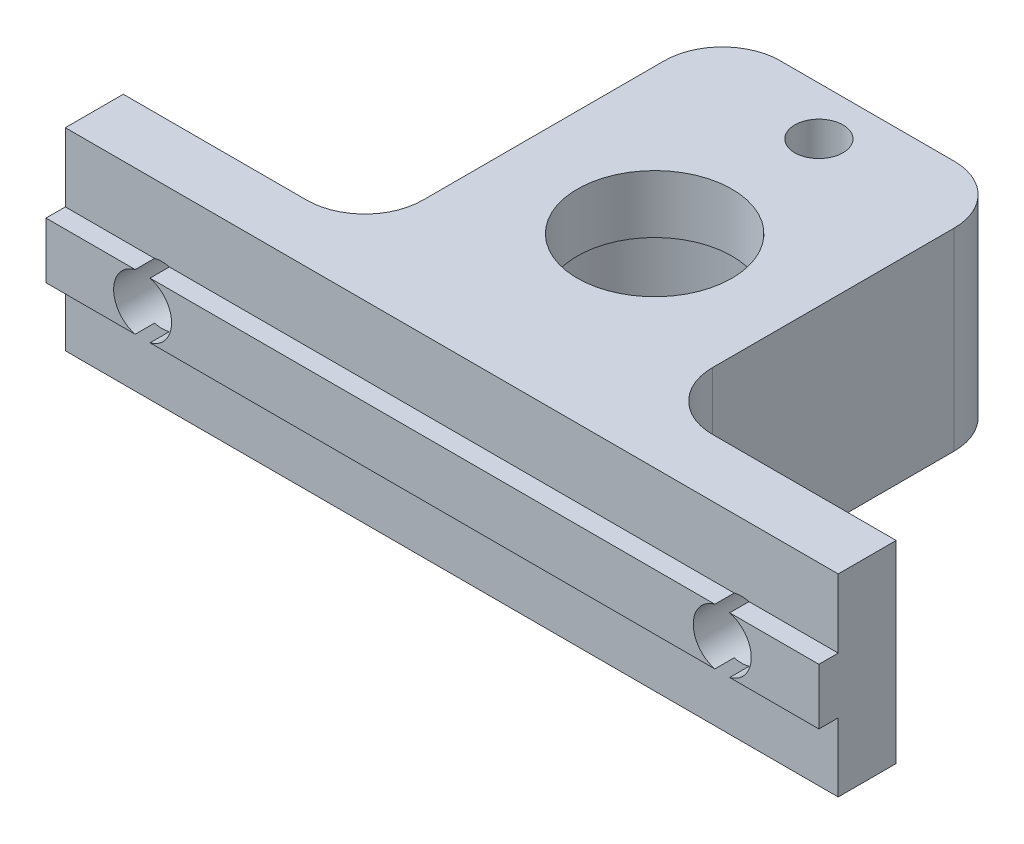
ISO-10303-21;
HEADER;
FILE_DESCRIPTION(('STEP AP214'),'2;1');
FILE_NAME('part.step','',(''),(''),'','','');
FILE_SCHEMA(('AUTOMOTIVE_DESIGN { 1 0 10303 214 1 1 1 1 }'));
ENDSEC;
DATA;
#1=APPLICATION_CONTEXT('core data for automotive mechanical design processes');
#2=APPLICATION_PROTOCOL_DEFINITION('international standard','automotive_design',2000,#1);
#3=PRODUCT_CONTEXT('',#1,'mechanical');
#4=PRODUCT('Part','Part','',(#3));
#5=PRODUCT_RELATED_PRODUCT_CATEGORY('part','',(#4));
#6=PRODUCT_DEFINITION_FORMATION('','',#4);
#7=PRODUCT_DEFINITION_CONTEXT('part definition',#1,'design');
#8=PRODUCT_DEFINITION('design','',#6,#7);
#9=PRODUCT_DEFINITION_SHAPE('','',#8);
#10=(LENGTH_UNIT() NAMED_UNIT(*) SI_UNIT(.MILLI.,.METRE.));
#11=(NAMED_UNIT(*) PLANE_ANGLE_UNIT() SI_UNIT($,.RADIAN.));
#12=(NAMED_UNIT(*) SI_UNIT($,.STERADIAN.) SOLID_ANGLE_UNIT());
#13=UNCERTAINTY_MEASURE_WITH_UNIT(LENGTH_MEASURE(1.E-05),#10,'distance_accuracy_value','');
#14=(GEOMETRIC_REPRESENTATION_CONTEXT(3) GLOBAL_UNCERTAINTY_ASSIGNED_CONTEXT((#13)) GLOBAL_UNIT_ASSIGNED_CONTEXT((#10,
#11,#12)) REPRESENTATION_CONTEXT('',''));
#15=CARTESIAN_POINT('',(0.,0.,0.));
#16=DIRECTION('',(0.,0.,1.));
#17=DIRECTION('',(1.,0.,0.));
#18=AXIS2_PLACEMENT_3D('',#15,#16,#17);
#19=CARTESIAN_POINT('',(0.,0.,0.));
#20=DIRECTION('',(0.,0.,-1.));
#21=DIRECTION('',(-1.,0.,0.));
#22=AXIS2_PLACEMENT_3D('',#19,#20,#21);
#23=PLANE('',#22);
#24=CARTESIAN_POINT('',(-15.,5.,0.));
#25=DIRECTION('',(0.,0.,-1.));
#26=DIRECTION('',(-1.,0.,0.));
#27=AXIS2_PLACEMENT_3D('',#24,#25,#26);
#28=CIRCLE('',#27,1.5);
#29=CARTESIAN_POINT('',(-16.5,5.,0.));
#30=VERTEX_POINT('',#29);
#31=EDGE_CURVE('E216',#30,#30,#28,.T.);
#32=ORIENTED_EDGE('',*,*,#31,.F.);
#33=EDGE_LOOP('',(#32));
#34=FACE_BOUND('',#33,.T.);
#35=DIRECTION('',(-1.,0.,0.));
#36=VECTOR('',#35,1.);
#37=CARTESIAN_POINT('',(-20.,10.,0.));
#38=LINE('',#37,#36);
#39=CARTESIAN_POINT('',(-10.5,10.,0.));
#40=VERTEX_POINT('',#39);
#41=CARTESIAN_POINT('',(-20.,10.,0.));
#42=VERTEX_POINT('',#41);
#43=EDGE_CURVE('E281',#40,#42,#38,.T.);
#44=ORIENTED_EDGE('',*,*,#43,.F.);
#45=DIRECTION('',(0.,-1.,0.));
#46=VECTOR('',#45,1.);
#47=CARTESIAN_POINT('',(-10.5,0.,0.));
#48=LINE('',#47,#46);
#49=CARTESIAN_POINT('',(-10.5,0.,0.));
#50=VERTEX_POINT('',#49);
#51=EDGE_CURVE('E326',#40,#50,#48,.T.);
#52=ORIENTED_EDGE('',*,*,#51,.T.);
#53=DIRECTION('',(1.,0.,0.));
#54=VECTOR('',#53,1.);
#55=CARTESIAN_POINT('',(-20.,0.,0.));
#56=LINE('',#55,#54);
#57=CARTESIAN_POINT('',(-20.,0.,0.));
#58=VERTEX_POINT('',#57);
#59=EDGE_CURVE('E276',#58,#50,#56,.T.);
#60=ORIENTED_EDGE('',*,*,#59,.F.);
#61=DIRECTION('',(0.,-1.,0.));
#62=VECTOR('',#61,1.);
#63=CARTESIAN_POINT('',(-20.,0.,0.));
#64=LINE('',#63,#62);
#65=EDGE_CURVE('E259',#42,#58,#64,.T.);
#66=ORIENTED_EDGE('',*,*,#65,.F.);
#67=EDGE_LOOP('',(#44,#52,#60,#66));
#68=FACE_BOUND('',#67,.T.);
#69=ADVANCED_FACE('F33',(#34,#68),#23,.T.);
#70=CARTESIAN_POINT('',(20.,6.45000000000001,4.));
#71=DIRECTION('',(0.,-1.,0.));
#72=DIRECTION('',(1.,0.,0.));
#73=AXIS2_PLACEMENT_3D('',#70,#71,#72);
#74=PLANE('',#73);
#75=DIRECTION('',(-1.,0.,0.));
#76=VECTOR('',#75,1.);
#77=CARTESIAN_POINT('',(20.,6.45000000000001,4.));
#78=LINE('',#77,#76);
#79=CARTESIAN_POINT('',(-15.3840572873934,6.45,4.));
#80=VERTEX_POINT('',#79);
#81=CARTESIAN_POINT('',(-20.,6.45,4.));
#82=VERTEX_POINT('',#81);
#83=EDGE_CURVE('E211',#80,#82,#78,.T.);
#84=ORIENTED_EDGE('',*,*,#83,.F.);
#85=DIRECTION('',(0.,0.,-1.));
#86=VECTOR('',#85,1.);
#87=CARTESIAN_POINT('',(-15.3840572873934,6.45,4.));
#88=LINE('',#87,#86);
#89=CARTESIAN_POINT('',(-15.3840572873934,6.45,3.));
#90=VERTEX_POINT('',#89);
#91=EDGE_CURVE('E195',#80,#90,#88,.T.);
#92=ORIENTED_EDGE('',*,*,#91,.T.);
#93=DIRECTION('',(-1.,0.,0.));
#94=VECTOR('',#93,1.);
#95=CARTESIAN_POINT('',(20.,6.45000000000001,3.));
#96=LINE('',#95,#94);
#97=CARTESIAN_POINT('',(-20.,6.45,3.));
#98=VERTEX_POINT('',#97);
#99=EDGE_CURVE('E246',#90,#98,#96,.T.);
#100=ORIENTED_EDGE('',*,*,#99,.T.);
#101=DIRECTION('',(0.,0.,-1.));
#102=VECTOR('',#101,1.);
#103=CARTESIAN_POINT('',(-20.,6.45,4.));
#104=LINE('',#103,#102);
#105=EDGE_CURVE('E220',#82,#98,#104,.T.);
#106=ORIENTED_EDGE('',*,*,#105,.F.);
#107=EDGE_LOOP('',(#84,#92,#100,#106));
#108=FACE_BOUND('',#107,.T.);
#109=ADVANCED_FACE('F218',(#108),#74,.F.);
#110=CARTESIAN_POINT('',(0.,0.,4.));
#111=DIRECTION('',(0.,0.,1.));
#112=DIRECTION('',(1.,0.,0.));
#113=AXIS2_PLACEMENT_3D('',#110,#111,#112);
#114=PLANE('',#113);
#115=CARTESIAN_POINT('',(-15.,5.,4.));
#116=DIRECTION('',(0.,0.,-1.));
#117=DIRECTION('',(-1.,0.,0.));
#118=AXIS2_PLACEMENT_3D('',#115,#116,#117);
#119=CIRCLE('',#118,1.5);
#120=CARTESIAN_POINT('',(-15.3840572873935,3.55,4.));
#121=VERTEX_POINT('',#120);
#122=EDGE_CURVE('E198',#121,#80,#119,.T.);
#123=ORIENTED_EDGE('',*,*,#122,.T.);
#124=ORIENTED_EDGE('',*,*,#83,.T.);
#125=DIRECTION('',(0.,-1.,0.));
#126=VECTOR('',#125,1.);
#127=CARTESIAN_POINT('',(-20.,3.55,4.));
#128=LINE('',#127,#126);
#129=CARTESIAN_POINT('',(-20.,3.55,4.));
#130=VERTEX_POINT('',#129);
#131=EDGE_CURVE('E232',#82,#130,#128,.T.);
#132=ORIENTED_EDGE('',*,*,#131,.T.);
#133=DIRECTION('',(1.,0.,0.));
#134=VECTOR('',#133,1.);
#135=CARTESIAN_POINT('',(20.,3.55000000000001,4.));
#136=LINE('',#135,#134);
#137=EDGE_CURVE('E214',#130,#121,#136,.T.);
#138=ORIENTED_EDGE('',*,*,#137,.T.);
#139=EDGE_LOOP('',(#123,#124,#132,#138));
#140=FACE_BOUND('',#139,.T.);
#141=ADVANCED_FACE('F210',(#140),#114,.T.);
#142=CARTESIAN_POINT('',(20.,3.55000000000001,4.));
#143=DIRECTION('',(0.,1.,0.));
#144=DIRECTION('',(-1.,0.,0.));
#145=AXIS2_PLACEMENT_3D('',#142,#143,#144);
#146=PLANE('',#145);
#147=CARTESIAN_POINT('',(-14.6159427126066,3.55,4.));
#148=VERTEX_POINT('',#147);
#149=CARTESIAN_POINT('',(14.6159427126066,3.55000000000001,4.));
#150=VERTEX_POINT('',#149);
#151=EDGE_CURVE('E237',#148,#150,#136,.T.);
#152=ORIENTED_EDGE('',*,*,#151,.F.);
#153=DIRECTION('',(0.,0.,-1.));
#154=VECTOR('',#153,1.);
#155=CARTESIAN_POINT('',(-14.6159427126066,3.55,4.));
#156=LINE('',#155,#154);
#157=CARTESIAN_POINT('',(-14.6159427126066,3.55,3.));
#158=VERTEX_POINT('',#157);
#159=EDGE_CURVE('E301',#148,#158,#156,.T.);
#160=ORIENTED_EDGE('',*,*,#159,.T.);
#161=DIRECTION('',(1.,0.,0.));
#162=VECTOR('',#161,1.);
#163=CARTESIAN_POINT('',(20.,3.55000000000001,3.));
#164=LINE('',#163,#162);
#165=CARTESIAN_POINT('',(14.6159427126066,3.55000000000001,3.));
#166=VERTEX_POINT('',#165);
#167=EDGE_CURVE('E249',#158,#166,#164,.T.);
#168=ORIENTED_EDGE('',*,*,#167,.T.);
#169=DIRECTION('',(0.,0.,-1.));
#170=VECTOR('',#169,1.);
#171=CARTESIAN_POINT('',(14.6159427126066,3.55000000000001,4.));
#172=LINE('',#171,#170);
#173=EDGE_CURVE('E379',#166,#150,#172,.F.);
#174=ORIENTED_EDGE('',*,*,#173,.T.);
#175=EDGE_LOOP('',(#152,#160,#168,#174));
#176=FACE_BOUND('',#175,.T.);
#177=ADVANCED_FACE('F516',(#176),#146,.F.);
#178=CARTESIAN_POINT('',(14.6159427126066,6.45000000000001,3.));
#179=VERTEX_POINT('',#178);
#180=CARTESIAN_POINT('',(-14.6159427126066,6.45,3.));
#181=VERTEX_POINT('',#180);
#182=EDGE_CURVE('E245',#179,#181,#96,.T.);
#183=ORIENTED_EDGE('',*,*,#182,.T.);
#184=DIRECTION('',(0.,0.,-1.));
#185=VECTOR('',#184,1.);
#186=CARTESIAN_POINT('',(-14.6159427126066,6.45,4.));
#187=LINE('',#186,#185);
#188=CARTESIAN_POINT('',(-14.6159427126066,6.45,4.));
#189=VERTEX_POINT('',#188);
#190=EDGE_CURVE('E206',#181,#189,#187,.F.);
#191=ORIENTED_EDGE('',*,*,#190,.T.);
#192=CARTESIAN_POINT('',(14.6159427126066,6.45000000000001,4.));
#193=VERTEX_POINT('',#192);
#194=EDGE_CURVE('E222',#193,#189,#78,.T.);
#195=ORIENTED_EDGE('',*,*,#194,.F.);
#196=DIRECTION('',(0.,0.,-1.));
#197=VECTOR('',#196,1.);
#198=CARTESIAN_POINT('',(14.6159427126066,6.45000000000001,4.));
#199=LINE('',#198,#197);
#200=EDGE_CURVE('E394',#193,#179,#199,.T.);
#201=ORIENTED_EDGE('',*,*,#200,.T.);
#202=EDGE_LOOP('',(#183,#191,#195,#201));
#203=FACE_BOUND('',#202,.T.);
#204=ADVANCED_FACE('F400',(#203),#74,.F.);
#205=CARTESIAN_POINT('',(15.3840572873934,3.55000000000001,4.));
#206=VERTEX_POINT('',#205);
#207=CARTESIAN_POINT('',(20.,3.55000000000001,4.));
#208=VERTEX_POINT('',#207);
#209=EDGE_CURVE('E235',#206,#208,#136,.T.);
#210=ORIENTED_EDGE('',*,*,#209,.F.);
#211=DIRECTION('',(0.,0.,-1.));
#212=VECTOR('',#211,1.);
#213=CARTESIAN_POINT('',(15.3840572873934,3.55000000000001,4.));
#214=LINE('',#213,#212);
#215=CARTESIAN_POINT('',(15.3840572873934,3.55000000000001,3.));
#216=VERTEX_POINT('',#215);
#217=EDGE_CURVE('E385',#206,#216,#214,.T.);
#218=ORIENTED_EDGE('',*,*,#217,.T.);
#219=CARTESIAN_POINT('',(20.,3.55000000000001,3.));
#220=VERTEX_POINT('',#219);
#221=EDGE_CURVE('E244',#216,#220,#164,.T.);
#222=ORIENTED_EDGE('',*,*,#221,.T.);
#223=DIRECTION('',(0.,0.,-1.));
#224=VECTOR('',#223,1.);
#225=CARTESIAN_POINT('',(20.,3.55000000000001,4.));
#226=LINE('',#225,#224);
#227=EDGE_CURVE('E240',#208,#220,#226,.T.);
#228=ORIENTED_EDGE('',*,*,#227,.F.);
#229=EDGE_LOOP('',(#210,#218,#222,#228));
#230=FACE_BOUND('',#229,.T.);
#231=ADVANCED_FACE('F421',(#230),#146,.F.);
#232=EDGE_CURVE('E215',#189,#148,#119,.T.);
#233=ORIENTED_EDGE('',*,*,#232,.T.);
#234=ORIENTED_EDGE('',*,*,#151,.T.);
#235=CARTESIAN_POINT('',(15.,5.00000000000001,4.));
#236=DIRECTION('',(0.,0.,1.));
#237=DIRECTION('',(1.,0.,0.));
#238=AXIS2_PLACEMENT_3D('',#235,#236,#237);
#239=CIRCLE('',#238,1.5);
#240=EDGE_CURVE('E298',#193,#150,#239,.T.);
#241=ORIENTED_EDGE('',*,*,#240,.F.);
#242=ORIENTED_EDGE('',*,*,#194,.T.);
#243=EDGE_LOOP('',(#233,#234,#241,#242));
#244=FACE_BOUND('',#243,.T.);
#245=ADVANCED_FACE('F514',(#244),#114,.T.);
#246=CARTESIAN_POINT('',(0.,0.,3.));
#247=DIRECTION('',(0.,0.,-1.));
#248=DIRECTION('',(-1.,0.,0.));
#249=AXIS2_PLACEMENT_3D('',#246,#247,#248);
#250=PLANE('',#249);
#251=ORIENTED_EDGE('',*,*,#167,.F.);
#252=CARTESIAN_POINT('',(-15.,5.,3.));
#253=DIRECTION('',(0.,0.,-1.));
#254=DIRECTION('',(-1.,0.,0.));
#255=AXIS2_PLACEMENT_3D('',#252,#253,#254);
#256=CIRCLE('',#255,1.5);
#257=CARTESIAN_POINT('',(-15.3840572873935,3.55,3.));
#258=VERTEX_POINT('',#257);
#259=EDGE_CURVE('E371',#158,#258,#256,.T.);
#260=ORIENTED_EDGE('',*,*,#259,.T.);
#261=CARTESIAN_POINT('',(-20.,3.55000000000001,3.));
#262=VERTEX_POINT('',#261);
#263=EDGE_CURVE('E228',#262,#258,#164,.T.);
#264=ORIENTED_EDGE('',*,*,#263,.F.);
#265=DIRECTION('',(0.,-1.,0.));
#266=VECTOR('',#265,1.);
#267=CARTESIAN_POINT('',(-20.,0.,3.));
#268=LINE('',#267,#266);
#269=CARTESIAN_POINT('',(-20.,0.,3.));
#270=VERTEX_POINT('',#269);
#271=EDGE_CURVE('E264',#262,#270,#268,.T.);
#272=ORIENTED_EDGE('',*,*,#271,.T.);
#273=DIRECTION('',(1.,0.,0.));
#274=VECTOR('',#273,1.);
#275=CARTESIAN_POINT('',(-20.,0.,3.));
#276=LINE('',#275,#274);
#277=CARTESIAN_POINT('',(20.,0.,3.));
#278=VERTEX_POINT('',#277);
#279=EDGE_CURVE('E263',#270,#278,#276,.T.);
#280=ORIENTED_EDGE('',*,*,#279,.T.);
#281=DIRECTION('',(0.,1.,0.));
#282=VECTOR('',#281,1.);
#283=CARTESIAN_POINT('',(20.,0.,3.));
#284=LINE('',#283,#282);
#285=EDGE_CURVE('E267',#278,#220,#284,.T.);
#286=ORIENTED_EDGE('',*,*,#285,.T.);
#287=ORIENTED_EDGE('',*,*,#221,.F.);
#288=CARTESIAN_POINT('',(15.,5.00000000000001,3.));
#289=DIRECTION('',(0.,0.,-1.));
#290=DIRECTION('',(-1.,0.,0.));
#291=AXIS2_PLACEMENT_3D('',#288,#289,#290);
#292=CIRCLE('',#291,1.5);
#293=EDGE_CURVE('E382',#216,#166,#292,.T.);
#294=ORIENTED_EDGE('',*,*,#293,.T.);
#295=EDGE_LOOP('',(#251,#260,#264,#272,#280,#286,#287,#294));
#296=FACE_BOUND('',#295,.T.);
#297=ADVANCED_FACE('F414',(#296),#250,.F.);
#298=ORIENTED_EDGE('',*,*,#99,.F.);
#299=CARTESIAN_POINT('',(-15.,5.,3.));
#300=DIRECTION('',(0.,0.,-1.));
#301=DIRECTION('',(-1.,0.,0.));
#302=AXIS2_PLACEMENT_3D('',#299,#300,#301);
#303=CIRCLE('',#302,1.5);
#304=EDGE_CURVE('E201',#90,#181,#303,.T.);
#305=ORIENTED_EDGE('',*,*,#304,.T.);
#306=ORIENTED_EDGE('',*,*,#182,.F.);
#307=CARTESIAN_POINT('',(15.,5.00000000000001,3.));
#308=DIRECTION('',(0.,0.,-1.));
#309=DIRECTION('',(-1.,0.,0.));
#310=AXIS2_PLACEMENT_3D('',#307,#308,#309);
#311=CIRCLE('',#310,1.5);
#312=CARTESIAN_POINT('',(15.3840572873934,6.45000000000001,3.));
#313=VERTEX_POINT('',#312);
#314=EDGE_CURVE('E391',#179,#313,#311,.T.);
#315=ORIENTED_EDGE('',*,*,#314,.T.);
#316=CARTESIAN_POINT('',(20.,6.45000000000001,3.));
#317=VERTEX_POINT('',#316);
#318=EDGE_CURVE('E241',#317,#313,#96,.T.);
#319=ORIENTED_EDGE('',*,*,#318,.F.);
#320=CARTESIAN_POINT('',(20.,10.,3.));
#321=VERTEX_POINT('',#320);
#322=EDGE_CURVE('E266',#317,#321,#284,.T.);
#323=ORIENTED_EDGE('',*,*,#322,.T.);
#324=DIRECTION('',(-1.,0.,0.));
#325=VECTOR('',#324,1.);
#326=CARTESIAN_POINT('',(-20.,10.,3.));
#327=LINE('',#326,#325);
#328=CARTESIAN_POINT('',(-20.,10.,3.));
#329=VERTEX_POINT('',#328);
#330=EDGE_CURVE('E270',#321,#329,#327,.T.);
#331=ORIENTED_EDGE('',*,*,#330,.T.);
#332=EDGE_CURVE('E260',#329,#98,#268,.T.);
#333=ORIENTED_EDGE('',*,*,#332,.T.);
#334=EDGE_LOOP('',(#298,#305,#306,#315,#319,#323,#331,#333));
#335=FACE_BOUND('',#334,.T.);
#336=ADVANCED_FACE('F402',(#335),#250,.F.);
#337=CARTESIAN_POINT('',(-20.,0.,3.));
#338=DIRECTION('',(1.,0.,0.));
#339=DIRECTION('',(0.,0.,-1.));
#340=AXIS2_PLACEMENT_3D('',#337,#338,#339);
#341=PLANE('',#340);
#342=ORIENTED_EDGE('',*,*,#65,.T.);
#343=DIRECTION('',(0.,0.,-1.));
#344=VECTOR('',#343,1.);
#345=CARTESIAN_POINT('',(-20.,0.,3.));
#346=LINE('',#345,#344);
#347=EDGE_CURVE('E293',#270,#58,#346,.T.);
#348=ORIENTED_EDGE('',*,*,#347,.F.);
#349=ORIENTED_EDGE('',*,*,#271,.F.);
#350=DIRECTION('',(0.,0.,-1.));
#351=VECTOR('',#350,1.);
#352=CARTESIAN_POINT('',(-20.,3.55,4.));
#353=LINE('',#352,#351);
#354=EDGE_CURVE('E252',#130,#262,#353,.T.);
#355=ORIENTED_EDGE('',*,*,#354,.F.);
#356=ORIENTED_EDGE('',*,*,#131,.F.);
#357=ORIENTED_EDGE('',*,*,#105,.T.);
#358=ORIENTED_EDGE('',*,*,#332,.F.);
#359=DIRECTION('',(0.,0.,-1.));
#360=VECTOR('',#359,1.);
#361=CARTESIAN_POINT('',(-20.,10.,3.));
#362=LINE('',#361,#360);
#363=EDGE_CURVE('E272',#329,#42,#362,.T.);
#364=ORIENTED_EDGE('',*,*,#363,.T.);
#365=EDGE_LOOP('',(#342,#348,#349,#355,#356,#357,#358,#364));
#366=FACE_BOUND('',#365,.T.);
#367=ADVANCED_FACE('F407',(#366),#341,.F.);
#368=CARTESIAN_POINT('',(-20.,0.,3.));
#369=DIRECTION('',(0.,1.,0.));
#370=DIRECTION('',(-1.,0.,0.));
#371=AXIS2_PLACEMENT_3D('',#368,#369,#370);
#372=PLANE('',#371);
#373=CARTESIAN_POINT('',(0.,0.,-16.));
#374=DIRECTION('',(0.,1.,0.));
#375=DIRECTION('',(-1.,0.,0.));
#376=AXIS2_PLACEMENT_3D('',#373,#374,#375);
#377=CIRCLE('',#376,1.25);
#378=CARTESIAN_POINT('',(-1.25,0.,-16.));
#379=VERTEX_POINT('',#378);
#380=EDGE_CURVE('E685',#379,#379,#377,.T.);
#381=ORIENTED_EDGE('',*,*,#380,.T.);
#382=EDGE_LOOP('',(#381));
#383=FACE_BOUND('',#382,.T.);
#384=CARTESIAN_POINT('',(0.,0.,-7.5));
#385=DIRECTION('',(0.,-1.,0.));
#386=DIRECTION('',(1.,0.,0.));
#387=AXIS2_PLACEMENT_3D('',#384,#385,#386);
#388=CIRCLE('',#387,6.2);
#389=CARTESIAN_POINT('',(6.2,0.,-7.5));
#390=VERTEX_POINT('',#389);
#391=EDGE_CURVE('E695',#390,#390,#388,.T.);
#392=ORIENTED_EDGE('',*,*,#391,.F.);
#393=EDGE_LOOP('',(#392));
#394=FACE_BOUND('',#393,.T.);
#395=DIRECTION('',(0.,0.,1.));
#396=VECTOR('',#395,1.);
#397=CARTESIAN_POINT('',(-7.5,0.,0.));
#398=LINE('',#397,#396);
#399=CARTESIAN_POINT('',(-7.5,0.,-15.5));
#400=VERTEX_POINT('',#399);
#401=CARTESIAN_POINT('',(-7.5,0.,-3.));
#402=VERTEX_POINT('',#401);
#403=EDGE_CURVE('E362',#400,#402,#398,.T.);
#404=ORIENTED_EDGE('',*,*,#403,.F.);
#405=CARTESIAN_POINT('',(-4.5,0.,-15.5));
#406=DIRECTION('',(0.,1.,0.));
#407=DIRECTION('',(-1.,0.,0.));
#408=AXIS2_PLACEMENT_3D('',#405,#406,#407);
#409=CIRCLE('',#408,3.);
#410=CARTESIAN_POINT('',(-4.5,0.,-18.5));
#411=VERTEX_POINT('',#410);
#412=EDGE_CURVE('E311',#400,#411,#409,.F.);
#413=ORIENTED_EDGE('',*,*,#412,.T.);
#414=DIRECTION('',(-1.,0.,0.));
#415=VECTOR('',#414,1.);
#416=CARTESIAN_POINT('',(-7.5,0.,-18.5));
#417=LINE('',#416,#415);
#418=CARTESIAN_POINT('',(4.5,0.,-18.5));
#419=VERTEX_POINT('',#418);
#420=EDGE_CURVE('E358',#419,#411,#417,.T.);
#421=ORIENTED_EDGE('',*,*,#420,.F.);
#422=CARTESIAN_POINT('',(4.5,0.,-15.5));
#423=DIRECTION('',(0.,1.,0.));
#424=DIRECTION('',(-1.,0.,0.));
#425=AXIS2_PLACEMENT_3D('',#422,#423,#424);
#426=CIRCLE('',#425,3.);
#427=CARTESIAN_POINT('',(7.5,0.,-15.5));
#428=VERTEX_POINT('',#427);
#429=EDGE_CURVE('E309',#419,#428,#426,.F.);
#430=ORIENTED_EDGE('',*,*,#429,.T.);
#431=DIRECTION('',(0.,0.,-1.));
#432=VECTOR('',#431,1.);
#433=CARTESIAN_POINT('',(7.5,0.,0.));
#434=LINE('',#433,#432);
#435=CARTESIAN_POINT('',(7.5,0.,-3.));
#436=VERTEX_POINT('',#435);
#437=EDGE_CURVE('E339',#436,#428,#434,.T.);
#438=ORIENTED_EDGE('',*,*,#437,.F.);
#439=CARTESIAN_POINT('',(10.5,0.,-3.));
#440=DIRECTION('',(0.,1.,0.));
#441=DIRECTION('',(-1.,0.,0.));
#442=AXIS2_PLACEMENT_3D('',#439,#440,#441);
#443=CIRCLE('',#442,3.);
#444=CARTESIAN_POINT('',(10.5,0.,0.));
#445=VERTEX_POINT('',#444);
#446=EDGE_CURVE('E41',#436,#445,#443,.T.);
#447=ORIENTED_EDGE('',*,*,#446,.T.);
#448=CARTESIAN_POINT('',(20.,0.,0.));
#449=VERTEX_POINT('',#448);
#450=EDGE_CURVE('E275',#445,#449,#56,.T.);
#451=ORIENTED_EDGE('',*,*,#450,.T.);
#452=DIRECTION('',(0.,0.,-1.));
#453=VECTOR('',#452,1.);
#454=CARTESIAN_POINT('',(20.,0.,3.));
#455=LINE('',#454,#453);
#456=EDGE_CURVE('E290',#278,#449,#455,.T.);
#457=ORIENTED_EDGE('',*,*,#456,.F.);
#458=ORIENTED_EDGE('',*,*,#279,.F.);
#459=ORIENTED_EDGE('',*,*,#347,.T.);
#460=ORIENTED_EDGE('',*,*,#59,.T.);
#461=CARTESIAN_POINT('',(-10.5,0.,-3.));
#462=DIRECTION('',(0.,1.,0.));
#463=DIRECTION('',(-1.,0.,0.));
#464=AXIS2_PLACEMENT_3D('',#461,#462,#463);
#465=CIRCLE('',#464,3.);
#466=EDGE_CURVE('E331',#50,#402,#465,.T.);
#467=ORIENTED_EDGE('',*,*,#466,.T.);
#468=EDGE_LOOP('',(#404,#413,#421,#430,#438,#447,#451,#457,#458,#459,#460,#467));
#469=FACE_BOUND('',#468,.T.);
#470=ADVANCED_FACE('F337',(#383,#394,#469),#372,.F.);
#471=CARTESIAN_POINT('',(20.,0.,3.));
#472=DIRECTION('',(-1.,0.,0.));
#473=DIRECTION('',(0.,-1.,0.));
#474=AXIS2_PLACEMENT_3D('',#471,#472,#473);
#475=PLANE('',#474);
#476=DIRECTION('',(0.,1.,0.));
#477=VECTOR('',#476,1.);
#478=CARTESIAN_POINT('',(20.,0.,0.));
#479=LINE('',#478,#477);
#480=CARTESIAN_POINT('',(20.,10.,0.));
#481=VERTEX_POINT('',#480);
#482=EDGE_CURVE('E279',#449,#481,#479,.T.);
#483=ORIENTED_EDGE('',*,*,#482,.T.);
#484=DIRECTION('',(0.,0.,-1.));
#485=VECTOR('',#484,1.);
#486=CARTESIAN_POINT('',(20.,10.,3.));
#487=LINE('',#486,#485);
#488=EDGE_CURVE('E287',#321,#481,#487,.T.);
#489=ORIENTED_EDGE('',*,*,#488,.F.);
#490=ORIENTED_EDGE('',*,*,#322,.F.);
#491=DIRECTION('',(0.,0.,-1.));
#492=VECTOR('',#491,1.);
#493=CARTESIAN_POINT('',(20.,6.45000000000001,4.));
#494=LINE('',#493,#492);
#495=CARTESIAN_POINT('',(20.,6.45000000000001,4.));
#496=VERTEX_POINT('',#495);
#497=EDGE_CURVE('E256',#496,#317,#494,.T.);
#498=ORIENTED_EDGE('',*,*,#497,.F.);
#499=DIRECTION('',(0.,1.,0.));
#500=VECTOR('',#499,1.);
#501=CARTESIAN_POINT('',(20.,3.55000000000001,4.));
#502=LINE('',#501,#500);
#503=EDGE_CURVE('E223',#208,#496,#502,.T.);
#504=ORIENTED_EDGE('',*,*,#503,.F.);
#505=ORIENTED_EDGE('',*,*,#227,.T.);
#506=ORIENTED_EDGE('',*,*,#285,.F.);
#507=ORIENTED_EDGE('',*,*,#456,.T.);
#508=EDGE_LOOP('',(#483,#489,#490,#498,#504,#505,#506,#507));
#509=FACE_BOUND('',#508,.T.);
#510=ADVANCED_FACE('F426',(#509),#475,.F.);
#511=CARTESIAN_POINT('',(-20.,10.,3.));
#512=DIRECTION('',(0.,-1.,0.));
#513=DIRECTION('',(1.,0.,0.));
#514=AXIS2_PLACEMENT_3D('',#511,#512,#513);
#515=PLANE('',#514);
#516=CARTESIAN_POINT('',(0.,10.,-16.));
#517=DIRECTION('',(0.,1.,0.));
#518=DIRECTION('',(-1.,0.,0.));
#519=AXIS2_PLACEMENT_3D('',#516,#517,#518);
#520=CIRCLE('',#519,1.25);
#521=CARTESIAN_POINT('',(-1.25,10.,-16.));
#522=VERTEX_POINT('',#521);
#523=EDGE_CURVE('E687',#522,#522,#520,.T.);
#524=ORIENTED_EDGE('',*,*,#523,.F.);
#525=EDGE_LOOP('',(#524));
#526=FACE_BOUND('',#525,.T.);
#527=CARTESIAN_POINT('',(0.,10.,-7.5));
#528=DIRECTION('',(0.,-1.,0.));
#529=DIRECTION('',(1.,0.,0.));
#530=AXIS2_PLACEMENT_3D('',#527,#528,#529);
#531=CIRCLE('',#530,4.);
#532=CARTESIAN_POINT('',(4.,10.,-7.5));
#533=VERTEX_POINT('',#532);
#534=EDGE_CURVE('E692',#533,#533,#531,.T.);
#535=ORIENTED_EDGE('',*,*,#534,.T.);
#536=EDGE_LOOP('',(#535));
#537=FACE_BOUND('',#536,.T.);
#538=DIRECTION('',(-1.,0.,0.));
#539=VECTOR('',#538,1.);
#540=CARTESIAN_POINT('',(-7.5,10.,-18.5));
#541=LINE('',#540,#539);
#542=CARTESIAN_POINT('',(4.5,10.,-18.5));
#543=VERTEX_POINT('',#542);
#544=CARTESIAN_POINT('',(-4.5,10.,-18.5));
#545=VERTEX_POINT('',#544);
#546=EDGE_CURVE('E354',#543,#545,#541,.T.);
#547=ORIENTED_EDGE('',*,*,#546,.T.);
#548=CARTESIAN_POINT('',(-4.5,10.,-15.5));
#549=DIRECTION('',(0.,-1.,0.));
#550=DIRECTION('',(1.,0.,0.));
#551=AXIS2_PLACEMENT_3D('',#548,#549,#550);
#552=CIRCLE('',#551,3.);
#553=CARTESIAN_POINT('',(-7.5,10.,-15.5));
#554=VERTEX_POINT('',#553);
#555=EDGE_CURVE('E320',#545,#554,#552,.F.);
#556=ORIENTED_EDGE('',*,*,#555,.T.);
#557=DIRECTION('',(0.,0.,1.));
#558=VECTOR('',#557,1.);
#559=CARTESIAN_POINT('',(-7.5,10.,0.));
#560=LINE('',#559,#558);
#561=CARTESIAN_POINT('',(-7.5,10.,-3.));
#562=VERTEX_POINT('',#561);
#563=EDGE_CURVE('E355',#554,#562,#560,.T.);
#564=ORIENTED_EDGE('',*,*,#563,.T.);
#565=CARTESIAN_POINT('',(-10.5,10.,-3.));
#566=DIRECTION('',(0.,-1.,0.));
#567=DIRECTION('',(1.,0.,0.));
#568=AXIS2_PLACEMENT_3D('',#565,#566,#567);
#569=CIRCLE('',#568,3.);
#570=EDGE_CURVE('E48',#562,#40,#569,.T.);
#571=ORIENTED_EDGE('',*,*,#570,.T.);
#572=ORIENTED_EDGE('',*,*,#43,.T.);
#573=ORIENTED_EDGE('',*,*,#363,.F.);
#574=ORIENTED_EDGE('',*,*,#330,.F.);
#575=ORIENTED_EDGE('',*,*,#488,.T.);
#576=CARTESIAN_POINT('',(10.5,10.,0.));
#577=VERTEX_POINT('',#576);
#578=EDGE_CURVE('E282',#481,#577,#38,.T.);
#579=ORIENTED_EDGE('',*,*,#578,.T.);
#580=CARTESIAN_POINT('',(10.5,10.,-3.));
#581=DIRECTION('',(0.,-1.,0.));
#582=DIRECTION('',(1.,0.,0.));
#583=AXIS2_PLACEMENT_3D('',#580,#581,#582);
#584=CIRCLE('',#583,3.);
#585=CARTESIAN_POINT('',(7.5,10.,-3.));
#586=VERTEX_POINT('',#585);
#587=EDGE_CURVE('E11',#577,#586,#584,.T.);
#588=ORIENTED_EDGE('',*,*,#587,.T.);
#589=DIRECTION('',(0.,0.,-1.));
#590=VECTOR('',#589,1.);
#591=CARTESIAN_POINT('',(7.5,10.,0.));
#592=LINE('',#591,#590);
#593=CARTESIAN_POINT('',(7.5,10.,-15.5));
#594=VERTEX_POINT('',#593);
#595=EDGE_CURVE('E351',#586,#594,#592,.T.);
#596=ORIENTED_EDGE('',*,*,#595,.T.);
#597=CARTESIAN_POINT('',(4.5,10.,-15.5));
#598=DIRECTION('',(0.,-1.,0.));
#599=DIRECTION('',(1.,0.,0.));
#600=AXIS2_PLACEMENT_3D('',#597,#598,#599);
#601=CIRCLE('',#600,3.);
#602=EDGE_CURVE('E318',#594,#543,#601,.F.);
#603=ORIENTED_EDGE('',*,*,#602,.T.);
#604=EDGE_LOOP('',(#547,#556,#564,#571,#572,#573,#574,#575,#579,#588,#596,#603));
#605=FACE_BOUND('',#604,.T.);
#606=ADVANCED_FACE('F350',(#526,#537,#605),#515,.F.);
#607=ORIENTED_EDGE('',*,*,#450,.F.);
#608=DIRECTION('',(0.,-1.,0.));
#609=VECTOR('',#608,1.);
#610=CARTESIAN_POINT('',(10.5,0.,0.));
#611=LINE('',#610,#609);
#612=EDGE_CURVE('E329',#445,#577,#611,.F.);
#613=ORIENTED_EDGE('',*,*,#612,.T.);
#614=ORIENTED_EDGE('',*,*,#578,.F.);
#615=ORIENTED_EDGE('',*,*,#482,.F.);
#616=EDGE_LOOP('',(#607,#613,#614,#615));
#617=FACE_BOUND('',#616,.T.);
#618=CARTESIAN_POINT('',(15.,5.00000000000001,0.));
#619=DIRECTION('',(0.,0.,-1.));
#620=DIRECTION('',(-1.,0.,0.));
#621=AXIS2_PLACEMENT_3D('',#618,#619,#620);
#622=CIRCLE('',#621,1.5);
#623=CARTESIAN_POINT('',(13.5,5.00000000000001,0.));
#624=VERTEX_POINT('',#623);
#625=EDGE_CURVE('E205',#624,#624,#622,.T.);
#626=ORIENTED_EDGE('',*,*,#625,.F.);
#627=EDGE_LOOP('',(#626));
#628=FACE_BOUND('',#627,.T.);
#629=ADVANCED_FACE('F345',(#617,#628),#23,.T.);
#630=ORIENTED_EDGE('',*,*,#318,.T.);
#631=DIRECTION('',(0.,0.,-1.));
#632=VECTOR('',#631,1.);
#633=CARTESIAN_POINT('',(15.3840572873934,6.45000000000001,4.));
#634=LINE('',#633,#632);
#635=CARTESIAN_POINT('',(15.3840572873934,6.45000000000001,4.));
#636=VERTEX_POINT('',#635);
#637=EDGE_CURVE('E388',#313,#636,#634,.F.);
#638=ORIENTED_EDGE('',*,*,#637,.T.);
#639=EDGE_CURVE('E225',#496,#636,#78,.T.);
#640=ORIENTED_EDGE('',*,*,#639,.F.);
#641=ORIENTED_EDGE('',*,*,#497,.T.);
#642=EDGE_LOOP('',(#630,#638,#640,#641));
#643=FACE_BOUND('',#642,.T.);
#644=ADVANCED_FACE('F434',(#643),#74,.F.);
#645=ORIENTED_EDGE('',*,*,#263,.T.);
#646=DIRECTION('',(0.,0.,-1.));
#647=VECTOR('',#646,1.);
#648=CARTESIAN_POINT('',(-15.3840572873935,3.55,4.));
#649=LINE('',#648,#647);
#650=EDGE_CURVE('E299',#258,#121,#649,.F.);
#651=ORIENTED_EDGE('',*,*,#650,.T.);
#652=ORIENTED_EDGE('',*,*,#137,.F.);
#653=ORIENTED_EDGE('',*,*,#354,.T.);
#654=EDGE_LOOP('',(#645,#651,#652,#653));
#655=FACE_BOUND('',#654,.T.);
#656=ADVANCED_FACE('F411',(#655),#146,.F.);
#657=EDGE_CURVE('E296',#206,#636,#239,.T.);
#658=ORIENTED_EDGE('',*,*,#657,.F.);
#659=ORIENTED_EDGE('',*,*,#209,.T.);
#660=ORIENTED_EDGE('',*,*,#503,.T.);
#661=ORIENTED_EDGE('',*,*,#639,.T.);
#662=EDGE_LOOP('',(#658,#659,#660,#661));
#663=FACE_BOUND('',#662,.T.);
#664=ADVANCED_FACE('F429',(#663),#114,.T.);
#665=CARTESIAN_POINT('',(15.,5.00000000000001,4.));
#666=DIRECTION('',(0.,0.,-1.));
#667=DIRECTION('',(-1.,0.,0.));
#668=AXIS2_PLACEMENT_3D('',#665,#666,#667);
#669=CYLINDRICAL_SURFACE('',#668,1.5);
#670=ORIENTED_EDGE('',*,*,#625,.T.);
#671=EDGE_LOOP('',(#670));
#672=FACE_BOUND('',#671,.T.);
#673=ORIENTED_EDGE('',*,*,#240,.T.);
#674=ORIENTED_EDGE('',*,*,#173,.F.);
#675=ORIENTED_EDGE('',*,*,#293,.F.);
#676=ORIENTED_EDGE('',*,*,#217,.F.);
#677=ORIENTED_EDGE('',*,*,#657,.T.);
#678=ORIENTED_EDGE('',*,*,#637,.F.);
#679=ORIENTED_EDGE('',*,*,#314,.F.);
#680=ORIENTED_EDGE('',*,*,#200,.F.);
#681=EDGE_LOOP('',(#673,#674,#675,#676,#677,#678,#679,#680));
#682=FACE_BOUND('',#681,.T.);
#683=ADVANCED_FACE('F432',(#672,#682),#669,.F.);
#684=CARTESIAN_POINT('',(-15.,5.,4.));
#685=DIRECTION('',(0.,0.,-1.));
#686=DIRECTION('',(-1.,0.,0.));
#687=AXIS2_PLACEMENT_3D('',#684,#685,#686);
#688=CYLINDRICAL_SURFACE('',#687,1.5);
#689=ORIENTED_EDGE('',*,*,#31,.T.);
#690=EDGE_LOOP('',(#689));
#691=FACE_BOUND('',#690,.T.);
#692=ORIENTED_EDGE('',*,*,#122,.F.);
#693=ORIENTED_EDGE('',*,*,#650,.F.);
#694=ORIENTED_EDGE('',*,*,#259,.F.);
#695=ORIENTED_EDGE('',*,*,#159,.F.);
#696=ORIENTED_EDGE('',*,*,#232,.F.);
#697=ORIENTED_EDGE('',*,*,#190,.F.);
#698=ORIENTED_EDGE('',*,*,#304,.F.);
#699=ORIENTED_EDGE('',*,*,#91,.F.);
#700=EDGE_LOOP('',(#692,#693,#694,#695,#696,#697,#698,#699));
#701=FACE_BOUND('',#700,.T.);
#702=ADVANCED_FACE('F197',(#691,#701),#688,.F.);
#703=CARTESIAN_POINT('',(-7.5,10.,0.));
#704=DIRECTION('',(1.,0.,0.));
#705=DIRECTION('',(0.,1.,0.));
#706=AXIS2_PLACEMENT_3D('',#703,#704,#705);
#707=PLANE('',#706);
#708=ORIENTED_EDGE('',*,*,#563,.F.);
#709=DIRECTION('',(0.,-1.,0.));
#710=VECTOR('',#709,1.);
#711=CARTESIAN_POINT('',(-7.5,10.,-15.5));
#712=LINE('',#711,#710);
#713=EDGE_CURVE('E306',#554,#400,#712,.T.);
#714=ORIENTED_EDGE('',*,*,#713,.T.);
#715=ORIENTED_EDGE('',*,*,#403,.T.);
#716=DIRECTION('',(0.,-1.,0.));
#717=VECTOR('',#716,1.);
#718=CARTESIAN_POINT('',(-7.5,10.,-3.));
#719=LINE('',#718,#717);
#720=EDGE_CURVE('E304',#402,#562,#719,.F.);
#721=ORIENTED_EDGE('',*,*,#720,.T.);
#722=EDGE_LOOP('',(#708,#714,#715,#721));
#723=FACE_BOUND('',#722,.T.);
#724=ADVANCED_FACE('F443',(#723),#707,.F.);
#725=CARTESIAN_POINT('',(7.5,10.,0.));
#726=DIRECTION('',(-1.,0.,0.));
#727=DIRECTION('',(0.,-1.,0.));
#728=AXIS2_PLACEMENT_3D('',#725,#726,#727);
#729=PLANE('',#728);
#730=ORIENTED_EDGE('',*,*,#437,.T.);
#731=DIRECTION('',(0.,-1.,0.));
#732=VECTOR('',#731,1.);
#733=CARTESIAN_POINT('',(7.5,10.,-15.5));
#734=LINE('',#733,#732);
#735=EDGE_CURVE('E56',#428,#594,#734,.F.);
#736=ORIENTED_EDGE('',*,*,#735,.T.);
#737=ORIENTED_EDGE('',*,*,#595,.F.);
#738=DIRECTION('',(0.,-1.,0.));
#739=VECTOR('',#738,1.);
#740=CARTESIAN_POINT('',(7.5,10.,-3.));
#741=LINE('',#740,#739);
#742=EDGE_CURVE('E322',#586,#436,#741,.T.);
#743=ORIENTED_EDGE('',*,*,#742,.T.);
#744=EDGE_LOOP('',(#730,#736,#737,#743));
#745=FACE_BOUND('',#744,.T.);
#746=ADVANCED_FACE('F353',(#745),#729,.F.);
#747=CARTESIAN_POINT('',(-7.5,10.,-18.5));
#748=DIRECTION('',(0.,0.,1.));
#749=DIRECTION('',(1.,0.,0.));
#750=AXIS2_PLACEMENT_3D('',#747,#748,#749);
#751=PLANE('',#750);
#752=ORIENTED_EDGE('',*,*,#420,.T.);
#753=DIRECTION('',(0.,-1.,0.));
#754=VECTOR('',#753,1.);
#755=CARTESIAN_POINT('',(-4.5,10.,-18.5));
#756=LINE('',#755,#754);
#757=EDGE_CURVE('E316',#411,#545,#756,.F.);
#758=ORIENTED_EDGE('',*,*,#757,.T.);
#759=ORIENTED_EDGE('',*,*,#546,.F.);
#760=DIRECTION('',(0.,-1.,0.));
#761=VECTOR('',#760,1.);
#762=CARTESIAN_POINT('',(4.5,10.,-18.5));
#763=LINE('',#762,#761);
#764=EDGE_CURVE('E313',#543,#419,#763,.T.);
#765=ORIENTED_EDGE('',*,*,#764,.T.);
#766=EDGE_LOOP('',(#752,#758,#759,#765));
#767=FACE_BOUND('',#766,.T.);
#768=ADVANCED_FACE('F485',(#767),#751,.F.);
#769=CARTESIAN_POINT('',(-4.5,10.,-15.5));
#770=DIRECTION('',(0.,-1.,0.));
#771=DIRECTION('',(1.,0.,0.));
#772=AXIS2_PLACEMENT_3D('',#769,#770,#771);
#773=CYLINDRICAL_SURFACE('',#772,3.);
#774=ORIENTED_EDGE('',*,*,#555,.F.);
#775=ORIENTED_EDGE('',*,*,#757,.F.);
#776=ORIENTED_EDGE('',*,*,#412,.F.);
#777=ORIENTED_EDGE('',*,*,#713,.F.);
#778=EDGE_LOOP('',(#774,#775,#776,#777));
#779=FACE_BOUND('',#778,.T.);
#780=ADVANCED_FACE('F453',(#779),#773,.T.);
#781=CARTESIAN_POINT('',(4.5,10.,-15.5));
#782=DIRECTION('',(0.,-1.,0.));
#783=DIRECTION('',(1.,0.,0.));
#784=AXIS2_PLACEMENT_3D('',#781,#782,#783);
#785=CYLINDRICAL_SURFACE('',#784,3.);
#786=ORIENTED_EDGE('',*,*,#602,.F.);
#787=ORIENTED_EDGE('',*,*,#735,.F.);
#788=ORIENTED_EDGE('',*,*,#429,.F.);
#789=ORIENTED_EDGE('',*,*,#764,.F.);
#790=EDGE_LOOP('',(#786,#787,#788,#789));
#791=FACE_BOUND('',#790,.T.);
#792=ADVANCED_FACE('F447',(#791),#785,.T.);
#793=CARTESIAN_POINT('',(-10.5,0.,-3.));
#794=DIRECTION('',(0.,-1.,0.));
#795=DIRECTION('',(1.,0.,0.));
#796=AXIS2_PLACEMENT_3D('',#793,#794,#795);
#797=CYLINDRICAL_SURFACE('',#796,3.);
#798=ORIENTED_EDGE('',*,*,#570,.F.);
#799=ORIENTED_EDGE('',*,*,#720,.F.);
#800=ORIENTED_EDGE('',*,*,#466,.F.);
#801=ORIENTED_EDGE('',*,*,#51,.F.);
#802=EDGE_LOOP('',(#798,#799,#800,#801));
#803=FACE_BOUND('',#802,.T.);
#804=ADVANCED_FACE('F445',(#803),#797,.F.);
#805=CARTESIAN_POINT('',(10.5,10.,-3.));
#806=DIRECTION('',(0.,-1.,0.));
#807=DIRECTION('',(1.,0.,0.));
#808=AXIS2_PLACEMENT_3D('',#805,#806,#807);
#809=CYLINDRICAL_SURFACE('',#808,3.);
#810=ORIENTED_EDGE('',*,*,#587,.F.);
#811=ORIENTED_EDGE('',*,*,#612,.F.);
#812=ORIENTED_EDGE('',*,*,#446,.F.);
#813=ORIENTED_EDGE('',*,*,#742,.F.);
#814=EDGE_LOOP('',(#810,#811,#812,#813));
#815=FACE_BOUND('',#814,.T.);
#816=ADVANCED_FACE('F35',(#815),#809,.F.);
#817=CARTESIAN_POINT('',(0.,7.,-7.5));
#818=DIRECTION('',(0.,-1.,0.));
#819=DIRECTION('',(1.,0.,0.));
#820=AXIS2_PLACEMENT_3D('',#817,#818,#819);
#821=CYLINDRICAL_SURFACE('',#820,6.2);
#822=CARTESIAN_POINT('',(0.,7.,-7.5));
#823=DIRECTION('',(0.,-1.,0.));
#824=DIRECTION('',(1.,0.,0.));
#825=AXIS2_PLACEMENT_3D('',#822,#823,#824);
#826=CIRCLE('',#825,6.2);
#827=CARTESIAN_POINT('',(6.2,7.,-7.5));
#828=VERTEX_POINT('',#827);
#829=EDGE_CURVE('E365',#828,#828,#826,.T.);
#830=ORIENTED_EDGE('',*,*,#829,.F.);
#831=EDGE_LOOP('',(#830));
#832=FACE_BOUND('',#831,.T.);
#833=ORIENTED_EDGE('',*,*,#391,.T.);
#834=EDGE_LOOP('',(#833));
#835=FACE_BOUND('',#834,.T.);
#836=ADVANCED_FACE('F452',(#832,#835),#821,.F.);
#837=CARTESIAN_POINT('',(0.,7.,-7.5));
#838=DIRECTION('',(0.,-1.,0.));
#839=DIRECTION('',(1.,0.,0.));
#840=AXIS2_PLACEMENT_3D('',#837,#838,#839);
#841=PLANE('',#840);
#842=CARTESIAN_POINT('',(0.,7.,-7.5));
#843=DIRECTION('',(0.,-1.,0.));
#844=DIRECTION('',(1.,0.,0.));
#845=AXIS2_PLACEMENT_3D('',#842,#843,#844);
#846=CIRCLE('',#845,4.);
#847=CARTESIAN_POINT('',(4.,7.,-7.5));
#848=VERTEX_POINT('',#847);
#849=EDGE_CURVE('E689',#848,#848,#846,.T.);
#850=ORIENTED_EDGE('',*,*,#849,.F.);
#851=EDGE_LOOP('',(#850));
#852=FACE_BOUND('',#851,.T.);
#853=ORIENTED_EDGE('',*,*,#829,.T.);
#854=EDGE_LOOP('',(#853));
#855=FACE_BOUND('',#854,.T.);
#856=ADVANCED_FACE('F652',(#852,#855),#841,.T.);
#857=CARTESIAN_POINT('',(0.,10.,-7.5));
#858=DIRECTION('',(0.,-1.,0.));
#859=DIRECTION('',(1.,0.,0.));
#860=AXIS2_PLACEMENT_3D('',#857,#858,#859);
#861=CYLINDRICAL_SURFACE('',#860,4.);
#862=ORIENTED_EDGE('',*,*,#534,.F.);
#863=EDGE_LOOP('',(#862));
#864=FACE_BOUND('',#863,.T.);
#865=ORIENTED_EDGE('',*,*,#849,.T.);
#866=EDGE_LOOP('',(#865));
#867=FACE_BOUND('',#866,.T.);
#868=ADVANCED_FACE('F660',(#864,#867),#861,.F.);
#869=CARTESIAN_POINT('',(0.,0.,-16.));
#870=DIRECTION('',(0.,1.,0.));
#871=DIRECTION('',(-1.,0.,0.));
#872=AXIS2_PLACEMENT_3D('',#869,#870,#871);
#873=CYLINDRICAL_SURFACE('',#872,1.25);
#874=ORIENTED_EDGE('',*,*,#380,.F.);
#875=EDGE_LOOP('',(#874));
#876=FACE_BOUND('',#875,.T.);
#877=ORIENTED_EDGE('',*,*,#523,.T.);
#878=EDGE_LOOP('',(#877));
#879=FACE_BOUND('',#878,.T.);
#880=ADVANCED_FACE('F667',(#876,#879),#873,.F.);
#881=CLOSED_SHELL('',(#69,#109,#141,#177,#204,#231,#245,#297,#336,#367,#470,#510,#606,#629,#644,
#656,#664,#683,#702,#724,#746,#768,#780,#792,#804,#816,#836,#856,#868,#880));
#882=MANIFOLD_SOLID_BREP('B2',#881);
#883=ADVANCED_BREP_SHAPE_REPRESENTATION('',(#18,#882),#14);
#884=SHAPE_DEFINITION_REPRESENTATION(#9,#883);
ENDSEC;
END-ISO-10303-21;
